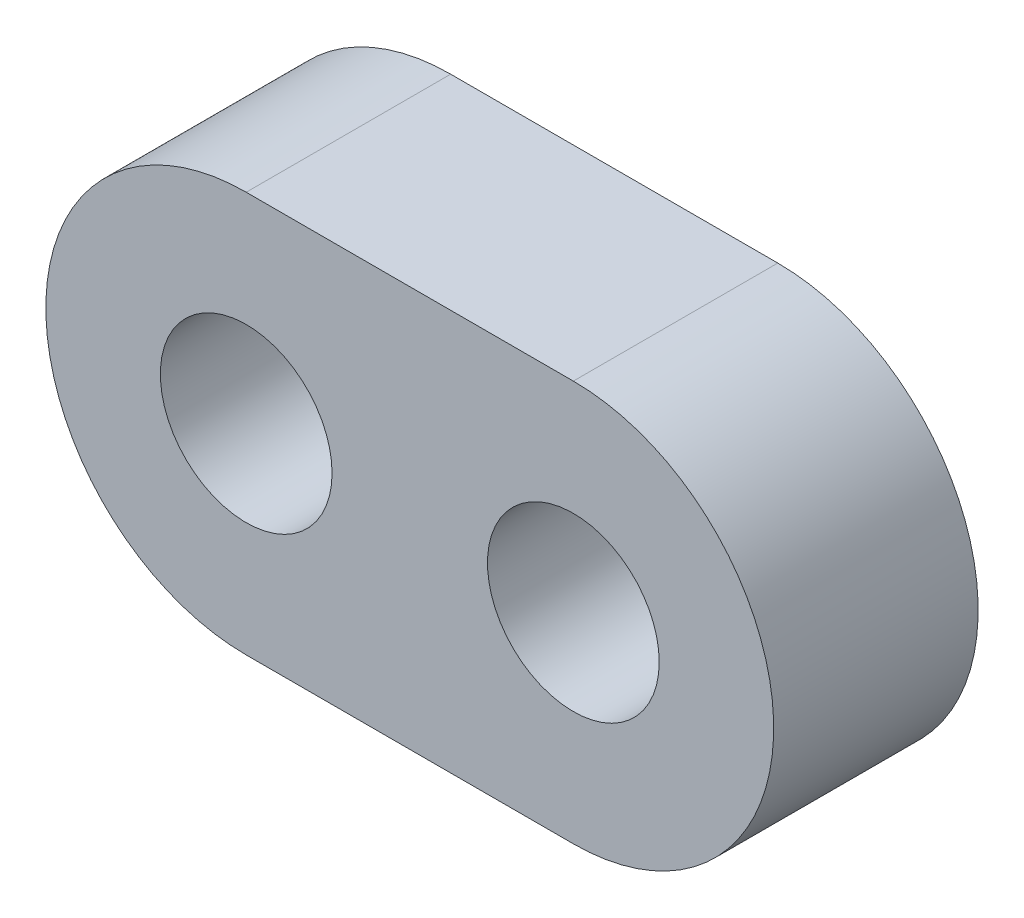
ISO-10303-21;
HEADER;
FILE_DESCRIPTION(('STEP AP214'),'2;1');
FILE_NAME('part.step','',(''),(''),'','','');
FILE_SCHEMA(('AUTOMOTIVE_DESIGN { 1 0 10303 214 1 1 1 1 }'));
ENDSEC;
DATA;
#1=APPLICATION_CONTEXT('core data for automotive mechanical design processes');
#2=APPLICATION_PROTOCOL_DEFINITION('international standard','automotive_design',2000,#1);
#3=PRODUCT_CONTEXT('',#1,'mechanical');
#4=PRODUCT('Part','Part','',(#3));
#5=PRODUCT_RELATED_PRODUCT_CATEGORY('part','',(#4));
#6=PRODUCT_DEFINITION_FORMATION('','',#4);
#7=PRODUCT_DEFINITION_CONTEXT('part definition',#1,'design');
#8=PRODUCT_DEFINITION('design','',#6,#7);
#9=PRODUCT_DEFINITION_SHAPE('','',#8);
#10=(LENGTH_UNIT() NAMED_UNIT(*) SI_UNIT(.MILLI.,.METRE.));
#11=(NAMED_UNIT(*) PLANE_ANGLE_UNIT() SI_UNIT($,.RADIAN.));
#12=(NAMED_UNIT(*) SI_UNIT($,.STERADIAN.) SOLID_ANGLE_UNIT());
#13=UNCERTAINTY_MEASURE_WITH_UNIT(LENGTH_MEASURE(1.E-05),#10,'distance_accuracy_value','');
#14=(GEOMETRIC_REPRESENTATION_CONTEXT(3) GLOBAL_UNCERTAINTY_ASSIGNED_CONTEXT((#13)) GLOBAL_UNIT_ASSIGNED_CONTEXT((#10,
#11,#12)) REPRESENTATION_CONTEXT('',''));
#15=CARTESIAN_POINT('',(0.,0.,0.));
#16=DIRECTION('',(0.,0.,1.));
#17=DIRECTION('',(1.,0.,0.));
#18=AXIS2_PLACEMENT_3D('',#15,#16,#17);
#19=CARTESIAN_POINT('',(-4.,0.,5.));
#20=DIRECTION('',(0.,0.,-1.));
#21=DIRECTION('',(-1.,0.,0.));
#22=AXIS2_PLACEMENT_3D('',#19,#20,#21);
#23=PLANE('',#22);
#24=CARTESIAN_POINT('',(-4.,0.,5.));
#25=DIRECTION('',(0.,0.,1.));
#26=DIRECTION('',(-1.,0.,0.));
#27=AXIS2_PLACEMENT_3D('',#24,#25,#26);
#28=CIRCLE('',#27,4.9);
#29=CARTESIAN_POINT('',(-4.,4.9,5.));
#30=VERTEX_POINT('',#29);
#31=CARTESIAN_POINT('',(-4.,-4.9,5.));
#32=VERTEX_POINT('',#31);
#33=EDGE_CURVE('E96',#30,#32,#28,.T.);
#34=ORIENTED_EDGE('',*,*,#33,.T.);
#35=DIRECTION('',(1.,0.,0.));
#36=VECTOR('',#35,1.);
#37=CARTESIAN_POINT('',(4.,-4.9,5.));
#38=LINE('',#37,#36);
#39=CARTESIAN_POINT('',(4.,-4.9,5.));
#40=VERTEX_POINT('',#39);
#41=EDGE_CURVE('E91',#32,#40,#38,.T.);
#42=ORIENTED_EDGE('',*,*,#41,.T.);
#43=CARTESIAN_POINT('',(4.,0.,5.));
#44=DIRECTION('',(0.,0.,1.));
#45=DIRECTION('',(-1.,0.,0.));
#46=AXIS2_PLACEMENT_3D('',#43,#44,#45);
#47=CIRCLE('',#46,4.9);
#48=CARTESIAN_POINT('',(4.,4.9,5.));
#49=VERTEX_POINT('',#48);
#50=EDGE_CURVE('E94',#40,#49,#47,.T.);
#51=ORIENTED_EDGE('',*,*,#50,.T.);
#52=DIRECTION('',(-1.,0.,0.));
#53=VECTOR('',#52,1.);
#54=CARTESIAN_POINT('',(-4.,4.9,5.));
#55=LINE('',#54,#53);
#56=EDGE_CURVE('E61',#49,#30,#55,.T.);
#57=ORIENTED_EDGE('',*,*,#56,.T.);
#58=EDGE_LOOP('',(#34,#42,#51,#57));
#59=FACE_BOUND('',#58,.T.);
#60=CARTESIAN_POINT('',(-4.,0.,5.));
#61=DIRECTION('',(0.,0.,1.));
#62=DIRECTION('',(1.,0.,0.));
#63=AXIS2_PLACEMENT_3D('',#60,#61,#62);
#64=CIRCLE('',#63,2.1);
#65=CARTESIAN_POINT('',(-1.9,0.,5.));
#66=VERTEX_POINT('',#65);
#67=EDGE_CURVE('E116',#66,#66,#64,.T.);
#68=ORIENTED_EDGE('',*,*,#67,.F.);
#69=EDGE_LOOP('',(#68));
#70=FACE_BOUND('',#69,.T.);
#71=CARTESIAN_POINT('',(4.,0.,5.));
#72=DIRECTION('',(0.,0.,1.));
#73=DIRECTION('',(1.,0.,0.));
#74=AXIS2_PLACEMENT_3D('',#71,#72,#73);
#75=CIRCLE('',#74,2.1);
#76=CARTESIAN_POINT('',(6.1,0.,5.));
#77=VERTEX_POINT('',#76);
#78=EDGE_CURVE('E138',#77,#77,#75,.T.);
#79=ORIENTED_EDGE('',*,*,#78,.F.);
#80=EDGE_LOOP('',(#79));
#81=FACE_BOUND('',#80,.T.);
#82=ADVANCED_FACE('F43',(#59,#70,#81),#23,.F.);
#83=CARTESIAN_POINT('',(-4.,0.,0.));
#84=DIRECTION('',(0.,0.,-1.));
#85=DIRECTION('',(-1.,0.,0.));
#86=AXIS2_PLACEMENT_3D('',#83,#84,#85);
#87=PLANE('',#86);
#88=CARTESIAN_POINT('',(-4.,0.,0.));
#89=DIRECTION('',(0.,0.,1.));
#90=DIRECTION('',(1.,0.,0.));
#91=AXIS2_PLACEMENT_3D('',#88,#89,#90);
#92=CIRCLE('',#91,2.1);
#93=CARTESIAN_POINT('',(-1.9,0.,0.));
#94=VERTEX_POINT('',#93);
#95=EDGE_CURVE('E134',#94,#94,#92,.T.);
#96=ORIENTED_EDGE('',*,*,#95,.T.);
#97=EDGE_LOOP('',(#96));
#98=FACE_BOUND('',#97,.T.);
#99=CARTESIAN_POINT('',(-4.,0.,0.));
#100=DIRECTION('',(0.,0.,1.));
#101=DIRECTION('',(-1.,0.,0.));
#102=AXIS2_PLACEMENT_3D('',#99,#100,#101);
#103=CIRCLE('',#102,4.9);
#104=CARTESIAN_POINT('',(-4.,4.9,0.));
#105=VERTEX_POINT('',#104);
#106=CARTESIAN_POINT('',(-4.,-4.9,0.));
#107=VERTEX_POINT('',#106);
#108=EDGE_CURVE('E112',#105,#107,#103,.T.);
#109=ORIENTED_EDGE('',*,*,#108,.F.);
#110=DIRECTION('',(-1.,0.,0.));
#111=VECTOR('',#110,1.);
#112=CARTESIAN_POINT('',(-4.,4.9,0.));
#113=LINE('',#112,#111);
#114=CARTESIAN_POINT('',(4.,4.9,0.));
#115=VERTEX_POINT('',#114);
#116=EDGE_CURVE('E84',#115,#105,#113,.T.);
#117=ORIENTED_EDGE('',*,*,#116,.F.);
#118=CARTESIAN_POINT('',(4.,0.,0.));
#119=DIRECTION('',(0.,0.,1.));
#120=DIRECTION('',(-1.,0.,0.));
#121=AXIS2_PLACEMENT_3D('',#118,#119,#120);
#122=CIRCLE('',#121,4.9);
#123=CARTESIAN_POINT('',(4.,-4.9,0.));
#124=VERTEX_POINT('',#123);
#125=EDGE_CURVE('E78',#124,#115,#122,.T.);
#126=ORIENTED_EDGE('',*,*,#125,.F.);
#127=DIRECTION('',(1.,0.,0.));
#128=VECTOR('',#127,1.);
#129=CARTESIAN_POINT('',(4.,-4.9,0.));
#130=LINE('',#129,#128);
#131=EDGE_CURVE('E101',#107,#124,#130,.T.);
#132=ORIENTED_EDGE('',*,*,#131,.F.);
#133=EDGE_LOOP('',(#109,#117,#126,#132));
#134=FACE_BOUND('',#133,.T.);
#135=CARTESIAN_POINT('',(4.,0.,0.));
#136=DIRECTION('',(0.,0.,1.));
#137=DIRECTION('',(1.,0.,0.));
#138=AXIS2_PLACEMENT_3D('',#135,#136,#137);
#139=CIRCLE('',#138,2.1);
#140=CARTESIAN_POINT('',(6.1,0.,0.));
#141=VERTEX_POINT('',#140);
#142=EDGE_CURVE('E142',#141,#141,#139,.T.);
#143=ORIENTED_EDGE('',*,*,#142,.T.);
#144=EDGE_LOOP('',(#143));
#145=FACE_BOUND('',#144,.T.);
#146=ADVANCED_FACE('F129',(#98,#134,#145),#87,.T.);
#147=CARTESIAN_POINT('',(-4.,0.,5.));
#148=DIRECTION('',(0.,0.,-1.));
#149=DIRECTION('',(-1.,0.,0.));
#150=AXIS2_PLACEMENT_3D('',#147,#148,#149);
#151=CYLINDRICAL_SURFACE('',#150,4.9);
#152=ORIENTED_EDGE('',*,*,#108,.T.);
#153=DIRECTION('',(0.,0.,-1.));
#154=VECTOR('',#153,1.);
#155=CARTESIAN_POINT('',(-4.,-4.9,5.));
#156=LINE('',#155,#154);
#157=EDGE_CURVE('E11',#32,#107,#156,.T.);
#158=ORIENTED_EDGE('',*,*,#157,.F.);
#159=ORIENTED_EDGE('',*,*,#33,.F.);
#160=DIRECTION('',(0.,0.,-1.));
#161=VECTOR('',#160,1.);
#162=CARTESIAN_POINT('',(-4.,4.9,5.));
#163=LINE('',#162,#161);
#164=EDGE_CURVE('E108',#30,#105,#163,.T.);
#165=ORIENTED_EDGE('',*,*,#164,.T.);
#166=EDGE_LOOP('',(#152,#158,#159,#165));
#167=FACE_BOUND('',#166,.T.);
#168=ADVANCED_FACE('F45',(#167),#151,.T.);
#169=CARTESIAN_POINT('',(4.,-4.9,5.));
#170=DIRECTION('',(0.,1.,0.));
#171=DIRECTION('',(-1.,0.,0.));
#172=AXIS2_PLACEMENT_3D('',#169,#170,#171);
#173=PLANE('',#172);
#174=ORIENTED_EDGE('',*,*,#131,.T.);
#175=DIRECTION('',(0.,0.,-1.));
#176=VECTOR('',#175,1.);
#177=CARTESIAN_POINT('',(4.,-4.9,5.));
#178=LINE('',#177,#176);
#179=EDGE_CURVE('E53',#40,#124,#178,.T.);
#180=ORIENTED_EDGE('',*,*,#179,.F.);
#181=ORIENTED_EDGE('',*,*,#41,.F.);
#182=ORIENTED_EDGE('',*,*,#157,.T.);
#183=EDGE_LOOP('',(#174,#180,#181,#182));
#184=FACE_BOUND('',#183,.T.);
#185=ADVANCED_FACE('F100',(#184),#173,.F.);
#186=CARTESIAN_POINT('',(4.,0.,5.));
#187=DIRECTION('',(0.,0.,-1.));
#188=DIRECTION('',(-1.,0.,0.));
#189=AXIS2_PLACEMENT_3D('',#186,#187,#188);
#190=CYLINDRICAL_SURFACE('',#189,4.9);
#191=ORIENTED_EDGE('',*,*,#125,.T.);
#192=DIRECTION('',(0.,0.,-1.));
#193=VECTOR('',#192,1.);
#194=CARTESIAN_POINT('',(4.,4.9,5.));
#195=LINE('',#194,#193);
#196=EDGE_CURVE('E103',#49,#115,#195,.T.);
#197=ORIENTED_EDGE('',*,*,#196,.F.);
#198=ORIENTED_EDGE('',*,*,#50,.F.);
#199=ORIENTED_EDGE('',*,*,#179,.T.);
#200=EDGE_LOOP('',(#191,#197,#198,#199));
#201=FACE_BOUND('',#200,.T.);
#202=ADVANCED_FACE('F104',(#201),#190,.T.);
#203=CARTESIAN_POINT('',(-4.,4.9,5.));
#204=DIRECTION('',(0.,-1.,0.));
#205=DIRECTION('',(1.,0.,0.));
#206=AXIS2_PLACEMENT_3D('',#203,#204,#205);
#207=PLANE('',#206);
#208=ORIENTED_EDGE('',*,*,#116,.T.);
#209=ORIENTED_EDGE('',*,*,#164,.F.);
#210=ORIENTED_EDGE('',*,*,#56,.F.);
#211=ORIENTED_EDGE('',*,*,#196,.T.);
#212=EDGE_LOOP('',(#208,#209,#210,#211));
#213=FACE_BOUND('',#212,.T.);
#214=ADVANCED_FACE('F126',(#213),#207,.F.);
#215=CARTESIAN_POINT('',(-4.,0.,5.));
#216=DIRECTION('',(0.,0.,-1.));
#217=DIRECTION('',(-1.,0.,0.));
#218=AXIS2_PLACEMENT_3D('',#215,#216,#217);
#219=CYLINDRICAL_SURFACE('',#218,2.1);
#220=ORIENTED_EDGE('',*,*,#67,.T.);
#221=EDGE_LOOP('',(#220));
#222=FACE_BOUND('',#221,.T.);
#223=ORIENTED_EDGE('',*,*,#95,.F.);
#224=EDGE_LOOP('',(#223));
#225=FACE_BOUND('',#224,.T.);
#226=ADVANCED_FACE('F161',(#222,#225),#219,.F.);
#227=CARTESIAN_POINT('',(4.,0.,5.));
#228=DIRECTION('',(0.,0.,-1.));
#229=DIRECTION('',(-1.,0.,0.));
#230=AXIS2_PLACEMENT_3D('',#227,#228,#229);
#231=CYLINDRICAL_SURFACE('',#230,2.1);
#232=ORIENTED_EDGE('',*,*,#78,.T.);
#233=EDGE_LOOP('',(#232));
#234=FACE_BOUND('',#233,.T.);
#235=ORIENTED_EDGE('',*,*,#142,.F.);
#236=EDGE_LOOP('',(#235));
#237=FACE_BOUND('',#236,.T.);
#238=ADVANCED_FACE('F150',(#234,#237),#231,.F.);
#239=CLOSED_SHELL('',(#82,#146,#168,#185,#202,#214,#226,#238));
#240=MANIFOLD_SOLID_BREP('B2',#239);
#241=ADVANCED_BREP_SHAPE_REPRESENTATION('',(#18,#240),#14);
#242=SHAPE_DEFINITION_REPRESENTATION(#9,#241);
ENDSEC;
END-ISO-10303-21;
